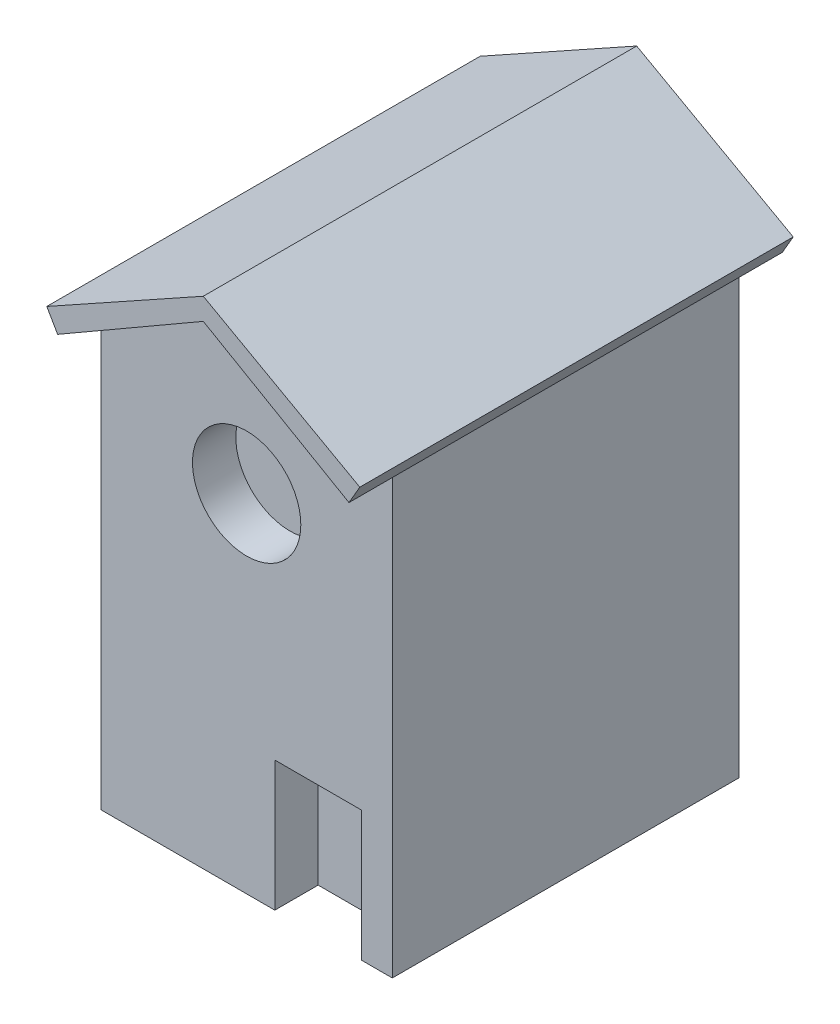
ISO-10303-21;
HEADER;
FILE_DESCRIPTION(('STEP AP214'),'2;1');
FILE_NAME('part.step','',(''),(''),'','','');
FILE_SCHEMA(('AUTOMOTIVE_DESIGN { 1 0 10303 214 1 1 1 1 }'));
ENDSEC;
DATA;
#1=APPLICATION_CONTEXT('core data for automotive mechanical design processes');
#2=APPLICATION_PROTOCOL_DEFINITION('international standard','automotive_design',2000,#1);
#3=PRODUCT_CONTEXT('',#1,'mechanical');
#4=PRODUCT('Part','Part','',(#3));
#5=PRODUCT_RELATED_PRODUCT_CATEGORY('part','',(#4));
#6=PRODUCT_DEFINITION_FORMATION('','',#4);
#7=PRODUCT_DEFINITION_CONTEXT('part definition',#1,'design');
#8=PRODUCT_DEFINITION('design','',#6,#7);
#9=PRODUCT_DEFINITION_SHAPE('','',#8);
#10=(LENGTH_UNIT() NAMED_UNIT(*) SI_UNIT(.MILLI.,.METRE.));
#11=(NAMED_UNIT(*) PLANE_ANGLE_UNIT() SI_UNIT($,.RADIAN.));
#12=(NAMED_UNIT(*) SI_UNIT($,.STERADIAN.) SOLID_ANGLE_UNIT());
#13=UNCERTAINTY_MEASURE_WITH_UNIT(LENGTH_MEASURE(1.E-05),#10,'distance_accuracy_value','');
#14=(GEOMETRIC_REPRESENTATION_CONTEXT(3) GLOBAL_UNCERTAINTY_ASSIGNED_CONTEXT((#13)) GLOBAL_UNIT_ASSIGNED_CONTEXT((#10,
#11,#12)) REPRESENTATION_CONTEXT('',''));
#15=CARTESIAN_POINT('',(0.,0.,0.));
#16=DIRECTION('',(0.,0.,1.));
#17=DIRECTION('',(1.,0.,0.));
#18=AXIS2_PLACEMENT_3D('',#15,#16,#17);
#19=CARTESIAN_POINT('',(-16.805,50.,20.));
#20=DIRECTION('',(1.,0.,0.));
#21=DIRECTION('',(0.,0.,-1.));
#22=AXIS2_PLACEMENT_3D('',#19,#20,#21);
#23=PLANE('',#22);
#24=DIRECTION('',(0.,-1.,0.));
#25=VECTOR('',#24,1.);
#26=CARTESIAN_POINT('',(-16.805,50.,-20.));
#27=LINE('',#26,#25);
#28=CARTESIAN_POINT('',(-16.805,50.,-20.));
#29=VERTEX_POINT('',#28);
#30=CARTESIAN_POINT('',(-16.805,0.,-20.));
#31=VERTEX_POINT('',#30);
#32=EDGE_CURVE('E199',#29,#31,#27,.T.);
#33=ORIENTED_EDGE('',*,*,#32,.T.);
#34=DIRECTION('',(0.,0.,-1.));
#35=VECTOR('',#34,1.);
#36=CARTESIAN_POINT('',(-16.805,0.,20.));
#37=LINE('',#36,#35);
#38=CARTESIAN_POINT('',(-16.805,0.,20.));
#39=VERTEX_POINT('',#38);
#40=EDGE_CURVE('E11',#39,#31,#37,.T.);
#41=ORIENTED_EDGE('',*,*,#40,.F.);
#42=DIRECTION('',(0.,-1.,0.));
#43=VECTOR('',#42,1.);
#44=CARTESIAN_POINT('',(-16.805,50.,20.));
#45=LINE('',#44,#43);
#46=CARTESIAN_POINT('',(-16.805,50.,20.));
#47=VERTEX_POINT('',#46);
#48=EDGE_CURVE('E208',#47,#39,#45,.T.);
#49=ORIENTED_EDGE('',*,*,#48,.F.);
#50=DIRECTION('',(0.,0.,-1.));
#51=VECTOR('',#50,1.);
#52=CARTESIAN_POINT('',(-16.805,50.,20.));
#53=LINE('',#52,#51);
#54=EDGE_CURVE('E84',#47,#29,#53,.T.);
#55=ORIENTED_EDGE('',*,*,#54,.T.);
#56=EDGE_LOOP('',(#33,#41,#49,#55));
#57=FACE_BOUND('',#56,.T.);
#58=ADVANCED_FACE('F39',(#57),#23,.F.);
#59=CARTESIAN_POINT('',(-16.805,0.,20.));
#60=DIRECTION('',(0.,1.,0.));
#61=DIRECTION('',(0.,0.,1.));
#62=AXIS2_PLACEMENT_3D('',#59,#60,#61);
#63=PLANE('',#62);
#64=DIRECTION('',(1.,0.,0.));
#65=VECTOR('',#64,1.);
#66=CARTESIAN_POINT('',(3.25,0.,15.));
#67=LINE('',#66,#65);
#68=CARTESIAN_POINT('',(3.25,0.,15.));
#69=VERTEX_POINT('',#68);
#70=CARTESIAN_POINT('',(13.25,0.,15.));
#71=VERTEX_POINT('',#70);
#72=EDGE_CURVE('E172',#69,#71,#67,.T.);
#73=ORIENTED_EDGE('',*,*,#72,.F.);
#74=DIRECTION('',(0.,0.,1.));
#75=VECTOR('',#74,1.);
#76=CARTESIAN_POINT('',(3.25,0.,15.));
#77=LINE('',#76,#75);
#78=CARTESIAN_POINT('',(3.25,0.,20.));
#79=VERTEX_POINT('',#78);
#80=EDGE_CURVE('E185',#69,#79,#77,.T.);
#81=ORIENTED_EDGE('',*,*,#80,.T.);
#82=DIRECTION('',(1.,0.,0.));
#83=VECTOR('',#82,1.);
#84=CARTESIAN_POINT('',(-16.805,0.,20.));
#85=LINE('',#84,#83);
#86=EDGE_CURVE('E92',#39,#79,#85,.T.);
#87=ORIENTED_EDGE('',*,*,#86,.F.);
#88=ORIENTED_EDGE('',*,*,#40,.T.);
#89=DIRECTION('',(1.,0.,0.));
#90=VECTOR('',#89,1.);
#91=CARTESIAN_POINT('',(-16.805,0.,-20.));
#92=LINE('',#91,#90);
#93=CARTESIAN_POINT('',(16.805,0.,-20.));
#94=VERTEX_POINT('',#93);
#95=EDGE_CURVE('E218',#31,#94,#92,.T.);
#96=ORIENTED_EDGE('',*,*,#95,.T.);
#97=DIRECTION('',(0.,0.,-1.));
#98=VECTOR('',#97,1.);
#99=CARTESIAN_POINT('',(16.805,0.,20.));
#100=LINE('',#99,#98);
#101=CARTESIAN_POINT('',(16.805,0.,20.));
#102=VERTEX_POINT('',#101);
#103=EDGE_CURVE('E47',#102,#94,#100,.T.);
#104=ORIENTED_EDGE('',*,*,#103,.F.);
#105=CARTESIAN_POINT('',(13.25,0.,20.));
#106=VERTEX_POINT('',#105);
#107=EDGE_CURVE('E107',#106,#102,#85,.T.);
#108=ORIENTED_EDGE('',*,*,#107,.F.);
#109=DIRECTION('',(0.,0.,1.));
#110=VECTOR('',#109,1.);
#111=CARTESIAN_POINT('',(13.25,0.,15.));
#112=LINE('',#111,#110);
#113=EDGE_CURVE('E54',#71,#106,#112,.T.);
#114=ORIENTED_EDGE('',*,*,#113,.F.);
#115=EDGE_LOOP('',(#73,#81,#87,#88,#96,#104,#108,#114));
#116=FACE_BOUND('',#115,.T.);
#117=ADVANCED_FACE('F285',(#116),#63,.F.);
#118=CARTESIAN_POINT('',(16.805,0.,20.));
#119=DIRECTION('',(-1.,0.,0.));
#120=DIRECTION('',(0.,-1.,0.));
#121=AXIS2_PLACEMENT_3D('',#118,#119,#120);
#122=PLANE('',#121);
#123=DIRECTION('',(0.,1.,0.));
#124=VECTOR('',#123,1.);
#125=CARTESIAN_POINT('',(16.805,0.,-20.));
#126=LINE('',#125,#124);
#127=CARTESIAN_POINT('',(16.805,50.,-20.));
#128=VERTEX_POINT('',#127);
#129=EDGE_CURVE('E117',#94,#128,#126,.T.);
#130=ORIENTED_EDGE('',*,*,#129,.T.);
#131=DIRECTION('',(0.,0.,-1.));
#132=VECTOR('',#131,1.);
#133=CARTESIAN_POINT('',(16.805,50.,20.));
#134=LINE('',#133,#132);
#135=CARTESIAN_POINT('',(16.805,50.,20.));
#136=VERTEX_POINT('',#135);
#137=EDGE_CURVE('E114',#136,#128,#134,.T.);
#138=ORIENTED_EDGE('',*,*,#137,.F.);
#139=DIRECTION('',(0.,1.,0.));
#140=VECTOR('',#139,1.);
#141=CARTESIAN_POINT('',(16.805,0.,20.));
#142=LINE('',#141,#140);
#143=EDGE_CURVE('E100',#102,#136,#142,.T.);
#144=ORIENTED_EDGE('',*,*,#143,.F.);
#145=ORIENTED_EDGE('',*,*,#103,.T.);
#146=EDGE_LOOP('',(#130,#138,#144,#145));
#147=FACE_BOUND('',#146,.T.);
#148=ADVANCED_FACE('F115',(#147),#122,.F.);
#149=CARTESIAN_POINT('',(0.,0.,20.));
#150=DIRECTION('',(0.,0.,1.));
#151=DIRECTION('',(1.,0.,0.));
#152=AXIS2_PLACEMENT_3D('',#149,#150,#151);
#153=PLANE('',#152);
#154=CARTESIAN_POINT('',(0.,40.,20.));
#155=DIRECTION('',(0.,0.,1.));
#156=DIRECTION('',(1.,0.,0.));
#157=AXIS2_PLACEMENT_3D('',#154,#155,#156);
#158=CIRCLE('',#157,6.25);
#159=CARTESIAN_POINT('',(6.25,40.,20.));
#160=VERTEX_POINT('',#159);
#161=EDGE_CURVE('E159',#160,#160,#158,.T.);
#162=ORIENTED_EDGE('',*,*,#161,.F.);
#163=EDGE_LOOP('',(#162));
#164=FACE_BOUND('',#163,.T.);
#165=DIRECTION('',(0.,-1.,0.));
#166=VECTOR('',#165,1.);
#167=CARTESIAN_POINT('',(3.25,0.,20.));
#168=LINE('',#167,#166);
#169=CARTESIAN_POINT('',(3.25,15.,20.));
#170=VERTEX_POINT('',#169);
#171=EDGE_CURVE('E164',#170,#79,#168,.T.);
#172=ORIENTED_EDGE('',*,*,#171,.F.);
#173=DIRECTION('',(-1.,0.,0.));
#174=VECTOR('',#173,1.);
#175=CARTESIAN_POINT('',(3.25,15.,20.));
#176=LINE('',#175,#174);
#177=CARTESIAN_POINT('',(13.25,15.,20.));
#178=VERTEX_POINT('',#177);
#179=EDGE_CURVE('E173',#178,#170,#176,.T.);
#180=ORIENTED_EDGE('',*,*,#179,.F.);
#181=DIRECTION('',(0.,1.,0.));
#182=VECTOR('',#181,1.);
#183=CARTESIAN_POINT('',(13.25,0.,20.));
#184=LINE('',#183,#182);
#185=EDGE_CURVE('E189',#106,#178,#184,.T.);
#186=ORIENTED_EDGE('',*,*,#185,.F.);
#187=ORIENTED_EDGE('',*,*,#107,.T.);
#188=ORIENTED_EDGE('',*,*,#143,.T.);
#189=DIRECTION('',(-0.866025403784438,0.500000000000001,0.));
#190=VECTOR('',#189,1.);
#191=CARTESIAN_POINT('',(16.805,50.,20.));
#192=LINE('',#191,#190);
#193=CARTESIAN_POINT('',(0.,59.7023712737317,20.));
#194=VERTEX_POINT('',#193);
#195=EDGE_CURVE('E105',#136,#194,#192,.T.);
#196=ORIENTED_EDGE('',*,*,#195,.T.);
#197=DIRECTION('',(-0.866025403784438,-0.500000000000001,0.));
#198=VECTOR('',#197,1.);
#199=CARTESIAN_POINT('',(0.,59.7023712737317,20.));
#200=LINE('',#199,#198);
#201=EDGE_CURVE('E63',#194,#47,#200,.T.);
#202=ORIENTED_EDGE('',*,*,#201,.T.);
#203=ORIENTED_EDGE('',*,*,#48,.T.);
#204=ORIENTED_EDGE('',*,*,#86,.T.);
#205=EDGE_LOOP('',(#172,#180,#186,#187,#188,#196,#202,#203,#204));
#206=FACE_BOUND('',#205,.T.);
#207=ADVANCED_FACE('F103',(#164,#206),#153,.T.);
#208=CARTESIAN_POINT('',(0.,0.,-20.));
#209=DIRECTION('',(0.,0.,1.));
#210=DIRECTION('',(1.,0.,0.));
#211=AXIS2_PLACEMENT_3D('',#208,#209,#210);
#212=PLANE('',#211);
#213=ORIENTED_EDGE('',*,*,#32,.F.);
#214=DIRECTION('',(-0.866025403784438,-0.500000000000001,0.));
#215=VECTOR('',#214,1.);
#216=CARTESIAN_POINT('',(0.,59.7023712737317,-20.));
#217=LINE('',#216,#215);
#218=CARTESIAN_POINT('',(0.,59.7023712737317,-20.));
#219=VERTEX_POINT('',#218);
#220=EDGE_CURVE('E211',#219,#29,#217,.T.);
#221=ORIENTED_EDGE('',*,*,#220,.F.);
#222=DIRECTION('',(-0.866025403784438,0.500000000000001,0.));
#223=VECTOR('',#222,1.);
#224=CARTESIAN_POINT('',(16.805,50.,-20.));
#225=LINE('',#224,#223);
#226=EDGE_CURVE('E223',#128,#219,#225,.T.);
#227=ORIENTED_EDGE('',*,*,#226,.F.);
#228=ORIENTED_EDGE('',*,*,#129,.F.);
#229=ORIENTED_EDGE('',*,*,#95,.F.);
#230=EDGE_LOOP('',(#213,#221,#227,#228,#229));
#231=FACE_BOUND('',#230,.T.);
#232=ADVANCED_FACE('F233',(#231),#212,.F.);
#233=CARTESIAN_POINT('',(3.25,0.,15.));
#234=DIRECTION('',(-1.,0.,0.));
#235=DIRECTION('',(0.,0.,1.));
#236=AXIS2_PLACEMENT_3D('',#233,#234,#235);
#237=PLANE('',#236);
#238=ORIENTED_EDGE('',*,*,#171,.T.);
#239=ORIENTED_EDGE('',*,*,#80,.F.);
#240=DIRECTION('',(0.,-1.,0.));
#241=VECTOR('',#240,1.);
#242=CARTESIAN_POINT('',(3.25,0.,15.));
#243=LINE('',#242,#241);
#244=CARTESIAN_POINT('',(3.25,15.,15.));
#245=VERTEX_POINT('',#244);
#246=EDGE_CURVE('E168',#245,#69,#243,.T.);
#247=ORIENTED_EDGE('',*,*,#246,.F.);
#248=DIRECTION('',(0.,0.,1.));
#249=VECTOR('',#248,1.);
#250=CARTESIAN_POINT('',(3.25,15.,15.));
#251=LINE('',#250,#249);
#252=EDGE_CURVE('E195',#245,#170,#251,.T.);
#253=ORIENTED_EDGE('',*,*,#252,.T.);
#254=EDGE_LOOP('',(#238,#239,#247,#253));
#255=FACE_BOUND('',#254,.T.);
#256=ADVANCED_FACE('F280',(#255),#237,.F.);
#257=CARTESIAN_POINT('',(3.25,15.,15.));
#258=DIRECTION('',(0.,1.,0.));
#259=DIRECTION('',(0.,0.,1.));
#260=AXIS2_PLACEMENT_3D('',#257,#258,#259);
#261=PLANE('',#260);
#262=ORIENTED_EDGE('',*,*,#179,.T.);
#263=ORIENTED_EDGE('',*,*,#252,.F.);
#264=DIRECTION('',(-1.,0.,0.));
#265=VECTOR('',#264,1.);
#266=CARTESIAN_POINT('',(3.25,15.,15.));
#267=LINE('',#266,#265);
#268=CARTESIAN_POINT('',(13.25,15.,15.));
#269=VERTEX_POINT('',#268);
#270=EDGE_CURVE('E181',#269,#245,#267,.T.);
#271=ORIENTED_EDGE('',*,*,#270,.F.);
#272=DIRECTION('',(0.,0.,1.));
#273=VECTOR('',#272,1.);
#274=CARTESIAN_POINT('',(13.25,15.,15.));
#275=LINE('',#274,#273);
#276=EDGE_CURVE('E200',#269,#178,#275,.T.);
#277=ORIENTED_EDGE('',*,*,#276,.T.);
#278=EDGE_LOOP('',(#262,#263,#271,#277));
#279=FACE_BOUND('',#278,.T.);
#280=ADVANCED_FACE('F282',(#279),#261,.F.);
#281=CARTESIAN_POINT('',(13.25,0.,15.));
#282=DIRECTION('',(1.,0.,0.));
#283=DIRECTION('',(0.,0.,-1.));
#284=AXIS2_PLACEMENT_3D('',#281,#282,#283);
#285=PLANE('',#284);
#286=ORIENTED_EDGE('',*,*,#185,.T.);
#287=ORIENTED_EDGE('',*,*,#276,.F.);
#288=DIRECTION('',(0.,1.,0.));
#289=VECTOR('',#288,1.);
#290=CARTESIAN_POINT('',(13.25,0.,15.));
#291=LINE('',#290,#289);
#292=EDGE_CURVE('E177',#71,#269,#291,.T.);
#293=ORIENTED_EDGE('',*,*,#292,.F.);
#294=ORIENTED_EDGE('',*,*,#113,.T.);
#295=EDGE_LOOP('',(#286,#287,#293,#294));
#296=FACE_BOUND('',#295,.T.);
#297=ADVANCED_FACE('F300',(#296),#285,.F.);
#298=CARTESIAN_POINT('',(0.,0.,15.));
#299=DIRECTION('',(0.,0.,-1.));
#300=DIRECTION('',(-1.,0.,0.));
#301=AXIS2_PLACEMENT_3D('',#298,#299,#300);
#302=PLANE('',#301);
#303=ORIENTED_EDGE('',*,*,#246,.T.);
#304=ORIENTED_EDGE('',*,*,#72,.T.);
#305=ORIENTED_EDGE('',*,*,#292,.T.);
#306=ORIENTED_EDGE('',*,*,#270,.T.);
#307=EDGE_LOOP('',(#303,#304,#305,#306));
#308=FACE_BOUND('',#307,.T.);
#309=ADVANCED_FACE('F303',(#308),#302,.F.);
#310=CARTESIAN_POINT('',(0.,40.,15.));
#311=DIRECTION('',(0.,0.,1.));
#312=DIRECTION('',(1.,0.,0.));
#313=AXIS2_PLACEMENT_3D('',#310,#311,#312);
#314=CYLINDRICAL_SURFACE('',#313,6.25);
#315=CARTESIAN_POINT('',(0.,40.,15.));
#316=DIRECTION('',(0.,0.,1.));
#317=DIRECTION('',(1.,0.,0.));
#318=AXIS2_PLACEMENT_3D('',#315,#316,#317);
#319=CIRCLE('',#318,6.25);
#320=CARTESIAN_POINT('',(6.25,40.,15.));
#321=VERTEX_POINT('',#320);
#322=EDGE_CURVE('E160',#321,#321,#319,.T.);
#323=ORIENTED_EDGE('',*,*,#322,.F.);
#324=EDGE_LOOP('',(#323));
#325=FACE_BOUND('',#324,.T.);
#326=ORIENTED_EDGE('',*,*,#161,.T.);
#327=EDGE_LOOP('',(#326));
#328=FACE_BOUND('',#327,.T.);
#329=ADVANCED_FACE('F308',(#325,#328),#314,.F.);
#330=CARTESIAN_POINT('',(0.,40.,15.));
#331=DIRECTION('',(0.,0.,1.));
#332=DIRECTION('',(1.,0.,0.));
#333=AXIS2_PLACEMENT_3D('',#330,#331,#332);
#334=PLANE('',#333);
#335=ORIENTED_EDGE('',*,*,#322,.T.);
#336=EDGE_LOOP('',(#335));
#337=FACE_BOUND('',#336,.T.);
#338=ADVANCED_FACE('F312',(#337),#334,.T.);
#339=CARTESIAN_POINT('',(-16.805,50.,25.));
#340=DIRECTION('',(-0.500000000000001,0.866025403784438,0.));
#341=DIRECTION('',(-0.866025403784438,-0.500000000000001,0.));
#342=AXIS2_PLACEMENT_3D('',#339,#340,#341);
#343=PLANE('',#342);
#344=DIRECTION('',(0.,0.,-1.));
#345=VECTOR('',#344,1.);
#346=CARTESIAN_POINT('',(0.,59.7023712737317,25.));
#347=LINE('',#346,#345);
#348=CARTESIAN_POINT('',(0.,59.7023712737317,-25.));
#349=VERTEX_POINT('',#348);
#350=EDGE_CURVE('E142',#219,#349,#347,.T.);
#351=ORIENTED_EDGE('',*,*,#350,.F.);
#352=ORIENTED_EDGE('',*,*,#220,.T.);
#353=DIRECTION('',(0.,0.,-1.));
#354=VECTOR('',#353,1.);
#355=CARTESIAN_POINT('',(-16.805,50.,25.));
#356=LINE('',#355,#354);
#357=CARTESIAN_POINT('',(-16.805,50.,-25.));
#358=VERTEX_POINT('',#357);
#359=EDGE_CURVE('E154',#29,#358,#356,.T.);
#360=ORIENTED_EDGE('',*,*,#359,.T.);
#361=DIRECTION('',(0.866025403784438,0.500000000000001,0.));
#362=VECTOR('',#361,1.);
#363=CARTESIAN_POINT('',(-16.805,50.,-25.));
#364=LINE('',#363,#362);
#365=EDGE_CURVE('E385',#358,#349,#364,.T.);
#366=ORIENTED_EDGE('',*,*,#365,.T.);
#367=EDGE_LOOP('',(#351,#352,#360,#366));
#368=FACE_BOUND('',#367,.T.);
#369=ADVANCED_FACE('F316',(#368),#343,.F.);
#370=CARTESIAN_POINT('',(0.,59.7023712737317,25.));
#371=DIRECTION('',(0.500000000000001,0.866025403784438,0.));
#372=DIRECTION('',(-0.866025403784438,0.500000000000001,0.));
#373=AXIS2_PLACEMENT_3D('',#370,#371,#372);
#374=PLANE('',#373);
#375=DIRECTION('',(0.,0.,-1.));
#376=VECTOR('',#375,1.);
#377=CARTESIAN_POINT('',(16.805,50.,25.));
#378=LINE('',#377,#376);
#379=CARTESIAN_POINT('',(16.805,50.,-25.));
#380=VERTEX_POINT('',#379);
#381=EDGE_CURVE('E143',#128,#380,#378,.T.);
#382=ORIENTED_EDGE('',*,*,#381,.F.);
#383=ORIENTED_EDGE('',*,*,#226,.T.);
#384=ORIENTED_EDGE('',*,*,#350,.T.);
#385=DIRECTION('',(0.866025403784438,-0.500000000000001,0.));
#386=VECTOR('',#385,1.);
#387=CARTESIAN_POINT('',(0.,59.7023712737317,-25.));
#388=LINE('',#387,#386);
#389=EDGE_CURVE('E243',#349,#380,#388,.T.);
#390=ORIENTED_EDGE('',*,*,#389,.T.);
#391=EDGE_LOOP('',(#382,#383,#384,#390));
#392=FACE_BOUND('',#391,.T.);
#393=ADVANCED_FACE('F240',(#392),#374,.F.);
#394=CARTESIAN_POINT('',(-18.055,52.1650635094611,25.));
#395=DIRECTION('',(0.866025403784437,0.500000000000003,0.));
#396=DIRECTION('',(-0.500000000000003,0.866025403784437,0.));
#397=AXIS2_PLACEMENT_3D('',#394,#395,#396);
#398=PLANE('',#397);
#399=DIRECTION('',(0.500000000000003,-0.866025403784437,0.));
#400=VECTOR('',#399,1.);
#401=CARTESIAN_POINT('',(-18.055,52.1650635094611,-25.));
#402=LINE('',#401,#400);
#403=CARTESIAN_POINT('',(-18.055,52.1650635094611,-25.));
#404=VERTEX_POINT('',#403);
#405=EDGE_CURVE('E382',#404,#358,#402,.T.);
#406=ORIENTED_EDGE('',*,*,#405,.T.);
#407=ORIENTED_EDGE('',*,*,#359,.F.);
#408=ORIENTED_EDGE('',*,*,#54,.F.);
#409=CARTESIAN_POINT('',(-16.805,50.,25.));
#410=VERTEX_POINT('',#409);
#411=EDGE_CURVE('E155',#410,#47,#356,.T.);
#412=ORIENTED_EDGE('',*,*,#411,.F.);
#413=DIRECTION('',(0.500000000000003,-0.866025403784437,0.));
#414=VECTOR('',#413,1.);
#415=CARTESIAN_POINT('',(-18.055,52.1650635094611,25.));
#416=LINE('',#415,#414);
#417=CARTESIAN_POINT('',(-18.055,52.1650635094611,25.));
#418=VERTEX_POINT('',#417);
#419=EDGE_CURVE('E351',#418,#410,#416,.T.);
#420=ORIENTED_EDGE('',*,*,#419,.F.);
#421=DIRECTION('',(0.,0.,-1.));
#422=VECTOR('',#421,1.);
#423=CARTESIAN_POINT('',(-18.055,52.1650635094611,25.));
#424=LINE('',#423,#422);
#425=EDGE_CURVE('E381',#418,#404,#424,.T.);
#426=ORIENTED_EDGE('',*,*,#425,.T.);
#427=EDGE_LOOP('',(#406,#407,#408,#412,#420,#426));
#428=FACE_BOUND('',#427,.T.);
#429=ADVANCED_FACE('F318',(#428),#398,.F.);
#430=ORIENTED_EDGE('',*,*,#201,.F.);
#431=CARTESIAN_POINT('',(0.,59.7023712737317,25.));
#432=VERTEX_POINT('',#431);
#433=EDGE_CURVE('E133',#432,#194,#347,.T.);
#434=ORIENTED_EDGE('',*,*,#433,.F.);
#435=DIRECTION('',(0.866025403784438,0.500000000000001,0.));
#436=VECTOR('',#435,1.);
#437=CARTESIAN_POINT('',(-16.805,50.,25.));
#438=LINE('',#437,#436);
#439=EDGE_CURVE('E356',#410,#432,#438,.T.);
#440=ORIENTED_EDGE('',*,*,#439,.F.);
#441=ORIENTED_EDGE('',*,*,#411,.T.);
#442=EDGE_LOOP('',(#430,#434,#440,#441));
#443=FACE_BOUND('',#442,.T.);
#444=ADVANCED_FACE('F321',(#443),#343,.F.);
#445=ORIENTED_EDGE('',*,*,#195,.F.);
#446=CARTESIAN_POINT('',(16.805,50.,25.));
#447=VERTEX_POINT('',#446);
#448=EDGE_CURVE('E130',#447,#136,#378,.T.);
#449=ORIENTED_EDGE('',*,*,#448,.F.);
#450=DIRECTION('',(0.866025403784438,-0.500000000000001,0.));
#451=VECTOR('',#450,1.);
#452=CARTESIAN_POINT('',(0.,59.7023712737317,25.));
#453=LINE('',#452,#451);
#454=EDGE_CURVE('E369',#432,#447,#453,.T.);
#455=ORIENTED_EDGE('',*,*,#454,.F.);
#456=ORIENTED_EDGE('',*,*,#433,.T.);
#457=EDGE_LOOP('',(#445,#449,#455,#456));
#458=FACE_BOUND('',#457,.T.);
#459=ADVANCED_FACE('F127',(#458),#374,.F.);
#460=CARTESIAN_POINT('',(16.805,50.,25.));
#461=DIRECTION('',(-0.866025403784438,0.500000000000001,0.));
#462=DIRECTION('',(-0.500000000000001,-0.866025403784438,0.));
#463=AXIS2_PLACEMENT_3D('',#460,#461,#462);
#464=PLANE('',#463);
#465=DIRECTION('',(0.500000000000001,0.866025403784438,0.));
#466=VECTOR('',#465,1.);
#467=CARTESIAN_POINT('',(16.805,50.,-25.));
#468=LINE('',#467,#466);
#469=CARTESIAN_POINT('',(18.055,52.1650635094611,-25.));
#470=VERTEX_POINT('',#469);
#471=EDGE_CURVE('E246',#380,#470,#468,.T.);
#472=ORIENTED_EDGE('',*,*,#471,.T.);
#473=DIRECTION('',(0.,0.,-1.));
#474=VECTOR('',#473,1.);
#475=CARTESIAN_POINT('',(18.055,52.1650635094611,25.));
#476=LINE('',#475,#474);
#477=CARTESIAN_POINT('',(18.055,52.1650635094611,25.));
#478=VERTEX_POINT('',#477);
#479=EDGE_CURVE('E149',#478,#470,#476,.T.);
#480=ORIENTED_EDGE('',*,*,#479,.F.);
#481=DIRECTION('',(0.500000000000001,0.866025403784438,0.));
#482=VECTOR('',#481,1.);
#483=CARTESIAN_POINT('',(16.805,50.,25.));
#484=LINE('',#483,#482);
#485=EDGE_CURVE('E140',#447,#478,#484,.T.);
#486=ORIENTED_EDGE('',*,*,#485,.F.);
#487=ORIENTED_EDGE('',*,*,#448,.T.);
#488=ORIENTED_EDGE('',*,*,#137,.T.);
#489=ORIENTED_EDGE('',*,*,#381,.T.);
#490=EDGE_LOOP('',(#472,#480,#486,#487,#488,#489));
#491=FACE_BOUND('',#490,.T.);
#492=ADVANCED_FACE('F137',(#491),#464,.F.);
#493=CARTESIAN_POINT('',(18.055,52.1650635094611,25.));
#494=DIRECTION('',(-0.486284519569205,-0.873800529885023,0.));
#495=DIRECTION('',(0.873800529885024,-0.486284519569205,0.));
#496=AXIS2_PLACEMENT_3D('',#493,#494,#495);
#497=PLANE('',#496);
#498=DIRECTION('',(-0.873800529885023,0.486284519569205,0.));
#499=VECTOR('',#498,1.);
#500=CARTESIAN_POINT('',(18.055,52.1650635094611,-25.));
#501=LINE('',#500,#499);
#502=CARTESIAN_POINT('',(0.,62.2129711274357,-25.));
#503=VERTEX_POINT('',#502);
#504=EDGE_CURVE('E393',#470,#503,#501,.T.);
#505=ORIENTED_EDGE('',*,*,#504,.T.);
#506=DIRECTION('',(0.,0.,-1.));
#507=VECTOR('',#506,1.);
#508=CARTESIAN_POINT('',(0.,62.2129711274357,25.));
#509=LINE('',#508,#507);
#510=CARTESIAN_POINT('',(0.,62.2129711274357,25.));
#511=VERTEX_POINT('',#510);
#512=EDGE_CURVE('E399',#511,#503,#509,.T.);
#513=ORIENTED_EDGE('',*,*,#512,.F.);
#514=DIRECTION('',(-0.873800529885023,0.486284519569205,0.));
#515=VECTOR('',#514,1.);
#516=CARTESIAN_POINT('',(18.055,52.1650635094611,25.));
#517=LINE('',#516,#515);
#518=EDGE_CURVE('E376',#478,#511,#517,.T.);
#519=ORIENTED_EDGE('',*,*,#518,.F.);
#520=ORIENTED_EDGE('',*,*,#479,.T.);
#521=EDGE_LOOP('',(#505,#513,#519,#520));
#522=FACE_BOUND('',#521,.T.);
#523=ADVANCED_FACE('F330',(#522),#497,.F.);
#524=CARTESIAN_POINT('',(0.,62.2129711274357,25.));
#525=DIRECTION('',(0.486284519569204,-0.873800529885024,0.));
#526=DIRECTION('',(0.873800529885024,0.486284519569204,0.));
#527=AXIS2_PLACEMENT_3D('',#524,#525,#526);
#528=PLANE('',#527);
#529=DIRECTION('',(-0.873800529885024,-0.486284519569204,0.));
#530=VECTOR('',#529,1.);
#531=CARTESIAN_POINT('',(0.,62.2129711274357,-25.));
#532=LINE('',#531,#530);
#533=EDGE_CURVE('E364',#503,#404,#532,.T.);
#534=ORIENTED_EDGE('',*,*,#533,.T.);
#535=ORIENTED_EDGE('',*,*,#425,.F.);
#536=DIRECTION('',(-0.873800529885024,-0.486284519569204,0.));
#537=VECTOR('',#536,1.);
#538=CARTESIAN_POINT('',(0.,62.2129711274357,25.));
#539=LINE('',#538,#537);
#540=EDGE_CURVE('E359',#511,#418,#539,.T.);
#541=ORIENTED_EDGE('',*,*,#540,.F.);
#542=ORIENTED_EDGE('',*,*,#512,.T.);
#543=EDGE_LOOP('',(#534,#535,#541,#542));
#544=FACE_BOUND('',#543,.T.);
#545=ADVANCED_FACE('F333',(#544),#528,.F.);
#546=CARTESIAN_POINT('',(0.,0.,25.));
#547=DIRECTION('',(0.,0.,1.));
#548=DIRECTION('',(1.,0.,0.));
#549=AXIS2_PLACEMENT_3D('',#546,#547,#548);
#550=PLANE('',#549);
#551=ORIENTED_EDGE('',*,*,#419,.T.);
#552=ORIENTED_EDGE('',*,*,#439,.T.);
#553=ORIENTED_EDGE('',*,*,#454,.T.);
#554=ORIENTED_EDGE('',*,*,#485,.T.);
#555=ORIENTED_EDGE('',*,*,#518,.T.);
#556=ORIENTED_EDGE('',*,*,#540,.T.);
#557=EDGE_LOOP('',(#551,#552,#553,#554,#555,#556));
#558=FACE_BOUND('',#557,.T.);
#559=ADVANCED_FACE('F337',(#558),#550,.T.);
#560=CARTESIAN_POINT('',(0.,0.,-25.));
#561=DIRECTION('',(0.,0.,1.));
#562=DIRECTION('',(1.,0.,0.));
#563=AXIS2_PLACEMENT_3D('',#560,#561,#562);
#564=PLANE('',#563);
#565=ORIENTED_EDGE('',*,*,#405,.F.);
#566=ORIENTED_EDGE('',*,*,#533,.F.);
#567=ORIENTED_EDGE('',*,*,#504,.F.);
#568=ORIENTED_EDGE('',*,*,#471,.F.);
#569=ORIENTED_EDGE('',*,*,#389,.F.);
#570=ORIENTED_EDGE('',*,*,#365,.F.);
#571=EDGE_LOOP('',(#565,#566,#567,#568,#569,#570));
#572=FACE_BOUND('',#571,.T.);
#573=ADVANCED_FACE('F339',(#572),#564,.F.);
#574=CLOSED_SHELL('',(#58,#117,#148,#207,#232,#256,#280,#297,#309,#329,#338,#369,#393,#429,#444,
#459,#492,#523,#545,#559,#573));
#575=MANIFOLD_SOLID_BREP('B2',#574);
#576=ADVANCED_BREP_SHAPE_REPRESENTATION('',(#18,#575),#14);
#577=SHAPE_DEFINITION_REPRESENTATION(#9,#576);
ENDSEC;
END-ISO-10303-21;
